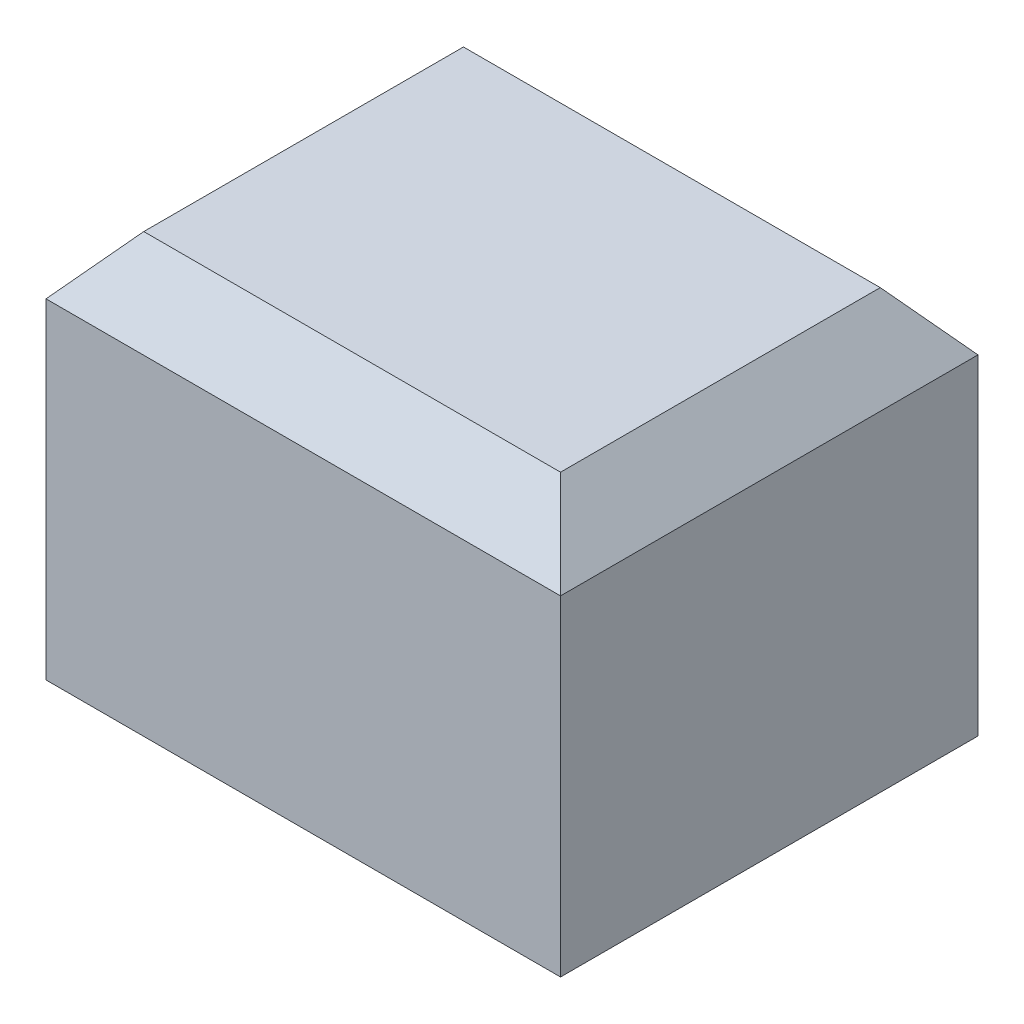
ISO-10303-21;
HEADER;
FILE_DESCRIPTION(('STEP AP214'),'2;1');
FILE_NAME('part.step','',(''),(''),'','','');
FILE_SCHEMA(('AUTOMOTIVE_DESIGN { 1 0 10303 214 1 1 1 1 }'));
ENDSEC;
DATA;
#1=APPLICATION_CONTEXT('core data for automotive mechanical design processes');
#2=APPLICATION_PROTOCOL_DEFINITION('international standard','automotive_design',2000,#1);
#3=PRODUCT_CONTEXT('',#1,'mechanical');
#4=PRODUCT('Part','Part','',(#3));
#5=PRODUCT_RELATED_PRODUCT_CATEGORY('part','',(#4));
#6=PRODUCT_DEFINITION_FORMATION('','',#4);
#7=PRODUCT_DEFINITION_CONTEXT('part definition',#1,'design');
#8=PRODUCT_DEFINITION('design','',#6,#7);
#9=PRODUCT_DEFINITION_SHAPE('','',#8);
#10=(LENGTH_UNIT() NAMED_UNIT(*) SI_UNIT(.MILLI.,.METRE.));
#11=(NAMED_UNIT(*) PLANE_ANGLE_UNIT() SI_UNIT($,.RADIAN.));
#12=(NAMED_UNIT(*) SI_UNIT($,.STERADIAN.) SOLID_ANGLE_UNIT());
#13=UNCERTAINTY_MEASURE_WITH_UNIT(LENGTH_MEASURE(1.E-05),#10,'distance_accuracy_value','');
#14=(GEOMETRIC_REPRESENTATION_CONTEXT(3) GLOBAL_UNCERTAINTY_ASSIGNED_CONTEXT((#13)) GLOBAL_UNIT_ASSIGNED_CONTEXT((#10,
#11,#12)) REPRESENTATION_CONTEXT('',''));
#15=CARTESIAN_POINT('',(0.,0.,0.));
#16=DIRECTION('',(0.,0.,1.));
#17=DIRECTION('',(1.,0.,0.));
#18=AXIS2_PLACEMENT_3D('',#15,#16,#17);
#19=CARTESIAN_POINT('',(0.,0.,0.));
#20=DIRECTION('',(0.,-1.,0.));
#21=DIRECTION('',(0.,0.,-1.));
#22=AXIS2_PLACEMENT_3D('',#19,#20,#21);
#23=PLANE('',#22);
#24=DIRECTION('',(0.,0.,1.));
#25=VECTOR('',#24,1.);
#26=CARTESIAN_POINT('',(-2.65,0.,2.15));
#27=LINE('',#26,#25);
#28=CARTESIAN_POINT('',(-2.65,0.,-2.15));
#29=VERTEX_POINT('',#28);
#30=CARTESIAN_POINT('',(-2.65,0.,2.15));
#31=VERTEX_POINT('',#30);
#32=EDGE_CURVE('E153',#29,#31,#27,.T.);
#33=ORIENTED_EDGE('',*,*,#32,.F.);
#34=DIRECTION('',(-1.,0.,0.));
#35=VECTOR('',#34,1.);
#36=CARTESIAN_POINT('',(-2.65,0.,-2.15));
#37=LINE('',#36,#35);
#38=CARTESIAN_POINT('',(2.65,0.,-2.15));
#39=VERTEX_POINT('',#38);
#40=EDGE_CURVE('E172',#39,#29,#37,.T.);
#41=ORIENTED_EDGE('',*,*,#40,.F.);
#42=DIRECTION('',(0.,0.,-1.));
#43=VECTOR('',#42,1.);
#44=CARTESIAN_POINT('',(2.65,0.,2.15));
#45=LINE('',#44,#43);
#46=CARTESIAN_POINT('',(2.65,0.,2.15));
#47=VERTEX_POINT('',#46);
#48=EDGE_CURVE('E168',#47,#39,#45,.T.);
#49=ORIENTED_EDGE('',*,*,#48,.F.);
#50=DIRECTION('',(1.,0.,0.));
#51=VECTOR('',#50,1.);
#52=CARTESIAN_POINT('',(-2.65,0.,2.15));
#53=LINE('',#52,#51);
#54=EDGE_CURVE('E159',#31,#47,#53,.T.);
#55=ORIENTED_EDGE('',*,*,#54,.F.);
#56=EDGE_LOOP('',(#33,#41,#49,#55));
#57=FACE_BOUND('',#56,.T.);
#58=DIRECTION('',(1.,0.,0.));
#59=VECTOR('',#58,1.);
#60=CARTESIAN_POINT('',(-1.55,0.,1.05));
#61=LINE('',#60,#59);
#62=CARTESIAN_POINT('',(-1.55,0.,1.05));
#63=VERTEX_POINT('',#62);
#64=CARTESIAN_POINT('',(1.55,0.,1.05));
#65=VERTEX_POINT('',#64);
#66=EDGE_CURVE('E147',#63,#65,#61,.T.);
#67=ORIENTED_EDGE('',*,*,#66,.T.);
#68=DIRECTION('',(0.,0.,-1.));
#69=VECTOR('',#68,1.);
#70=CARTESIAN_POINT('',(1.55,0.,1.05));
#71=LINE('',#70,#69);
#72=CARTESIAN_POINT('',(1.55,0.,-1.05));
#73=VERTEX_POINT('',#72);
#74=EDGE_CURVE('E223',#65,#73,#71,.T.);
#75=ORIENTED_EDGE('',*,*,#74,.T.);
#76=DIRECTION('',(-1.,0.,0.));
#77=VECTOR('',#76,1.);
#78=CARTESIAN_POINT('',(-1.55,0.,-1.05));
#79=LINE('',#78,#77);
#80=CARTESIAN_POINT('',(-1.55,0.,-1.05));
#81=VERTEX_POINT('',#80);
#82=EDGE_CURVE('E151',#73,#81,#79,.T.);
#83=ORIENTED_EDGE('',*,*,#82,.T.);
#84=DIRECTION('',(0.,0.,1.));
#85=VECTOR('',#84,1.);
#86=CARTESIAN_POINT('',(-1.55,0.,1.05));
#87=LINE('',#86,#85);
#88=EDGE_CURVE('E232',#81,#63,#87,.T.);
#89=ORIENTED_EDGE('',*,*,#88,.T.);
#90=EDGE_LOOP('',(#67,#75,#83,#89));
#91=FACE_BOUND('',#90,.T.);
#92=ADVANCED_FACE('F47',(#57,#91),#23,.T.);
#93=CARTESIAN_POINT('',(-2.65,2.8,2.15));
#94=DIRECTION('',(1.,0.,0.));
#95=DIRECTION('',(0.,0.,-1.));
#96=AXIS2_PLACEMENT_3D('',#93,#94,#95);
#97=PLANE('',#96);
#98=DIRECTION('',(0.,-1.,0.));
#99=VECTOR('',#98,1.);
#100=CARTESIAN_POINT('',(-2.65,2.8,2.15));
#101=LINE('',#100,#99);
#102=CARTESIAN_POINT('',(-2.65,3.4,2.15));
#103=VERTEX_POINT('',#102);
#104=EDGE_CURVE('E185',#103,#31,#101,.T.);
#105=ORIENTED_EDGE('',*,*,#104,.F.);
#106=DIRECTION('',(0.,0.,-1.));
#107=VECTOR('',#106,1.);
#108=CARTESIAN_POINT('',(-2.65,3.4,2.15));
#109=LINE('',#108,#107);
#110=CARTESIAN_POINT('',(-2.65,3.4,-2.15));
#111=VERTEX_POINT('',#110);
#112=EDGE_CURVE('E11',#103,#111,#109,.T.);
#113=ORIENTED_EDGE('',*,*,#112,.T.);
#114=DIRECTION('',(0.,-1.,0.));
#115=VECTOR('',#114,1.);
#116=CARTESIAN_POINT('',(-2.65,2.8,-2.15));
#117=LINE('',#116,#115);
#118=EDGE_CURVE('E176',#111,#29,#117,.T.);
#119=ORIENTED_EDGE('',*,*,#118,.T.);
#120=ORIENTED_EDGE('',*,*,#32,.T.);
#121=EDGE_LOOP('',(#105,#113,#119,#120));
#122=FACE_BOUND('',#121,.T.);
#123=ADVANCED_FACE('F253',(#122),#97,.F.);
#124=CARTESIAN_POINT('',(-2.65,2.8,2.15));
#125=DIRECTION('',(0.,0.,-1.));
#126=DIRECTION('',(-1.,0.,0.));
#127=AXIS2_PLACEMENT_3D('',#124,#125,#126);
#128=PLANE('',#127);
#129=DIRECTION('',(0.,-1.,0.));
#130=VECTOR('',#129,1.);
#131=CARTESIAN_POINT('',(2.65,2.8,2.15));
#132=LINE('',#131,#130);
#133=CARTESIAN_POINT('',(2.65,3.4,2.15));
#134=VERTEX_POINT('',#133);
#135=EDGE_CURVE('E182',#134,#47,#132,.T.);
#136=ORIENTED_EDGE('',*,*,#135,.F.);
#137=DIRECTION('',(-1.,0.,0.));
#138=VECTOR('',#137,1.);
#139=CARTESIAN_POINT('',(-2.65,3.4,2.15));
#140=LINE('',#139,#138);
#141=EDGE_CURVE('E58',#134,#103,#140,.T.);
#142=ORIENTED_EDGE('',*,*,#141,.T.);
#143=ORIENTED_EDGE('',*,*,#104,.T.);
#144=ORIENTED_EDGE('',*,*,#54,.T.);
#145=EDGE_LOOP('',(#136,#142,#143,#144));
#146=FACE_BOUND('',#145,.T.);
#147=ADVANCED_FACE('F260',(#146),#128,.F.);
#148=CARTESIAN_POINT('',(2.65,2.8,2.15));
#149=DIRECTION('',(-1.,0.,0.));
#150=DIRECTION('',(0.,0.,1.));
#151=AXIS2_PLACEMENT_3D('',#148,#149,#150);
#152=PLANE('',#151);
#153=DIRECTION('',(0.,-1.,0.));
#154=VECTOR('',#153,1.);
#155=CARTESIAN_POINT('',(2.65,2.8,-2.15));
#156=LINE('',#155,#154);
#157=CARTESIAN_POINT('',(2.65,3.4,-2.15));
#158=VERTEX_POINT('',#157);
#159=EDGE_CURVE('E179',#158,#39,#156,.T.);
#160=ORIENTED_EDGE('',*,*,#159,.F.);
#161=DIRECTION('',(0.,0.,1.));
#162=VECTOR('',#161,1.);
#163=CARTESIAN_POINT('',(2.65,3.4,2.15));
#164=LINE('',#163,#162);
#165=EDGE_CURVE('E73',#158,#134,#164,.T.);
#166=ORIENTED_EDGE('',*,*,#165,.T.);
#167=ORIENTED_EDGE('',*,*,#135,.T.);
#168=ORIENTED_EDGE('',*,*,#48,.T.);
#169=EDGE_LOOP('',(#160,#166,#167,#168));
#170=FACE_BOUND('',#169,.T.);
#171=ADVANCED_FACE('F270',(#170),#152,.F.);
#172=CARTESIAN_POINT('',(-2.65,2.8,-2.15));
#173=DIRECTION('',(0.,0.,1.));
#174=DIRECTION('',(1.,0.,0.));
#175=AXIS2_PLACEMENT_3D('',#172,#173,#174);
#176=PLANE('',#175);
#177=ORIENTED_EDGE('',*,*,#118,.F.);
#178=DIRECTION('',(1.,0.,0.));
#179=VECTOR('',#178,1.);
#180=CARTESIAN_POINT('',(-2.65,3.4,-2.15));
#181=LINE('',#180,#179);
#182=EDGE_CURVE('E201',#111,#158,#181,.T.);
#183=ORIENTED_EDGE('',*,*,#182,.T.);
#184=ORIENTED_EDGE('',*,*,#159,.T.);
#185=ORIENTED_EDGE('',*,*,#40,.T.);
#186=EDGE_LOOP('',(#177,#183,#184,#185));
#187=FACE_BOUND('',#186,.T.);
#188=ADVANCED_FACE('F267',(#187),#176,.F.);
#189=CARTESIAN_POINT('',(1.55,2.8,1.05));
#190=DIRECTION('',(-1.,0.,0.));
#191=DIRECTION('',(0.,0.,1.));
#192=AXIS2_PLACEMENT_3D('',#189,#190,#191);
#193=PLANE('',#192);
#194=ORIENTED_EDGE('',*,*,#74,.F.);
#195=DIRECTION('',(0.,-1.,0.));
#196=VECTOR('',#195,1.);
#197=CARTESIAN_POINT('',(1.55,2.8,1.05));
#198=LINE('',#197,#196);
#199=CARTESIAN_POINT('',(1.55,2.8,1.05));
#200=VERTEX_POINT('',#199);
#201=EDGE_CURVE('E145',#200,#65,#198,.T.);
#202=ORIENTED_EDGE('',*,*,#201,.F.);
#203=DIRECTION('',(0.,0.,-1.));
#204=VECTOR('',#203,1.);
#205=CARTESIAN_POINT('',(1.55,2.8,1.05));
#206=LINE('',#205,#204);
#207=CARTESIAN_POINT('',(1.55,2.8,-1.05));
#208=VERTEX_POINT('',#207);
#209=EDGE_CURVE('E129',#200,#208,#206,.T.);
#210=ORIENTED_EDGE('',*,*,#209,.T.);
#211=DIRECTION('',(0.,-1.,0.));
#212=VECTOR('',#211,1.);
#213=CARTESIAN_POINT('',(1.55,2.8,-1.05));
#214=LINE('',#213,#212);
#215=EDGE_CURVE('E142',#208,#73,#214,.T.);
#216=ORIENTED_EDGE('',*,*,#215,.T.);
#217=EDGE_LOOP('',(#194,#202,#210,#216));
#218=FACE_BOUND('',#217,.T.);
#219=ADVANCED_FACE('F141',(#218),#193,.T.);
#220=CARTESIAN_POINT('',(-1.55,2.8,-1.05));
#221=DIRECTION('',(0.,0.,1.));
#222=DIRECTION('',(1.,0.,0.));
#223=AXIS2_PLACEMENT_3D('',#220,#221,#222);
#224=PLANE('',#223);
#225=ORIENTED_EDGE('',*,*,#82,.F.);
#226=ORIENTED_EDGE('',*,*,#215,.F.);
#227=DIRECTION('',(-1.,0.,0.));
#228=VECTOR('',#227,1.);
#229=CARTESIAN_POINT('',(-1.55,2.8,-1.05));
#230=LINE('',#229,#228);
#231=CARTESIAN_POINT('',(-1.55,2.8,-1.05));
#232=VERTEX_POINT('',#231);
#233=EDGE_CURVE('E126',#208,#232,#230,.T.);
#234=ORIENTED_EDGE('',*,*,#233,.T.);
#235=DIRECTION('',(0.,-1.,0.));
#236=VECTOR('',#235,1.);
#237=CARTESIAN_POINT('',(-1.55,2.8,-1.05));
#238=LINE('',#237,#236);
#239=EDGE_CURVE('E154',#232,#81,#238,.T.);
#240=ORIENTED_EDGE('',*,*,#239,.T.);
#241=EDGE_LOOP('',(#225,#226,#234,#240));
#242=FACE_BOUND('',#241,.T.);
#243=ADVANCED_FACE('F149',(#242),#224,.T.);
#244=CARTESIAN_POINT('',(-1.55,2.8,1.05));
#245=DIRECTION('',(1.,0.,0.));
#246=DIRECTION('',(0.,0.,-1.));
#247=AXIS2_PLACEMENT_3D('',#244,#245,#246);
#248=PLANE('',#247);
#249=ORIENTED_EDGE('',*,*,#88,.F.);
#250=ORIENTED_EDGE('',*,*,#239,.F.);
#251=DIRECTION('',(0.,0.,1.));
#252=VECTOR('',#251,1.);
#253=CARTESIAN_POINT('',(-1.55,2.8,1.05));
#254=LINE('',#253,#252);
#255=CARTESIAN_POINT('',(-1.55,2.8,1.05));
#256=VERTEX_POINT('',#255);
#257=EDGE_CURVE('E132',#232,#256,#254,.T.);
#258=ORIENTED_EDGE('',*,*,#257,.T.);
#259=DIRECTION('',(0.,-1.,0.));
#260=VECTOR('',#259,1.);
#261=CARTESIAN_POINT('',(-1.55,2.8,1.05));
#262=LINE('',#261,#260);
#263=EDGE_CURVE('E161',#256,#63,#262,.T.);
#264=ORIENTED_EDGE('',*,*,#263,.T.);
#265=EDGE_LOOP('',(#249,#250,#258,#264));
#266=FACE_BOUND('',#265,.T.);
#267=ADVANCED_FACE('F249',(#266),#248,.T.);
#268=CARTESIAN_POINT('',(-1.55,2.8,1.05));
#269=DIRECTION('',(0.,0.,-1.));
#270=DIRECTION('',(-1.,0.,0.));
#271=AXIS2_PLACEMENT_3D('',#268,#269,#270);
#272=PLANE('',#271);
#273=ORIENTED_EDGE('',*,*,#66,.F.);
#274=ORIENTED_EDGE('',*,*,#263,.F.);
#275=DIRECTION('',(1.,0.,0.));
#276=VECTOR('',#275,1.);
#277=CARTESIAN_POINT('',(-1.55,2.8,1.05));
#278=LINE('',#277,#276);
#279=EDGE_CURVE('E235',#256,#200,#278,.T.);
#280=ORIENTED_EDGE('',*,*,#279,.T.);
#281=ORIENTED_EDGE('',*,*,#201,.T.);
#282=EDGE_LOOP('',(#273,#274,#280,#281));
#283=FACE_BOUND('',#282,.T.);
#284=ADVANCED_FACE('F251',(#283),#272,.T.);
#285=CARTESIAN_POINT('',(0.,2.8,0.));
#286=DIRECTION('',(0.,-1.,0.));
#287=DIRECTION('',(0.,0.,-1.));
#288=AXIS2_PLACEMENT_3D('',#285,#286,#287);
#289=PLANE('',#288);
#290=ORIENTED_EDGE('',*,*,#209,.F.);
#291=ORIENTED_EDGE('',*,*,#279,.F.);
#292=ORIENTED_EDGE('',*,*,#257,.F.);
#293=ORIENTED_EDGE('',*,*,#233,.F.);
#294=EDGE_LOOP('',(#290,#291,#292,#293));
#295=FACE_BOUND('',#294,.T.);
#296=ADVANCED_FACE('F128',(#295),#289,.T.);
#297=CARTESIAN_POINT('',(0.,4.,0.));
#298=DIRECTION('',(0.,-1.,0.));
#299=DIRECTION('',(0.,0.,-1.));
#300=AXIS2_PLACEMENT_3D('',#297,#298,#299);
#301=PLANE('',#300);
#302=DIRECTION('',(0.,0.,-1.));
#303=VECTOR('',#302,1.);
#304=CARTESIAN_POINT('',(2.14654022129363,4.,0.));
#305=LINE('',#304,#303);
#306=CARTESIAN_POINT('',(2.14654022129363,4.,1.64654022129363));
#307=VERTEX_POINT('',#306);
#308=CARTESIAN_POINT('',(2.14654022129363,4.,-1.64654022129363));
#309=VERTEX_POINT('',#308);
#310=EDGE_CURVE('E194',#307,#309,#305,.T.);
#311=ORIENTED_EDGE('',*,*,#310,.T.);
#312=DIRECTION('',(-1.,0.,0.));
#313=VECTOR('',#312,1.);
#314=CARTESIAN_POINT('',(0.,4.,-1.64654022129363));
#315=LINE('',#314,#313);
#316=CARTESIAN_POINT('',(-2.14654022129363,4.,-1.64654022129363));
#317=VERTEX_POINT('',#316);
#318=EDGE_CURVE('E197',#309,#317,#315,.T.);
#319=ORIENTED_EDGE('',*,*,#318,.T.);
#320=DIRECTION('',(0.,0.,1.));
#321=VECTOR('',#320,1.);
#322=CARTESIAN_POINT('',(-2.14654022129363,4.,0.));
#323=LINE('',#322,#321);
#324=CARTESIAN_POINT('',(-2.14654022129363,4.,1.64654022129363));
#325=VERTEX_POINT('',#324);
#326=EDGE_CURVE('E188',#317,#325,#323,.T.);
#327=ORIENTED_EDGE('',*,*,#326,.T.);
#328=DIRECTION('',(1.,0.,0.));
#329=VECTOR('',#328,1.);
#330=CARTESIAN_POINT('',(0.,4.,1.64654022129363));
#331=LINE('',#330,#329);
#332=EDGE_CURVE('E191',#325,#307,#331,.T.);
#333=ORIENTED_EDGE('',*,*,#332,.T.);
#334=EDGE_LOOP('',(#311,#319,#327,#333));
#335=FACE_BOUND('',#334,.T.);
#336=ADVANCED_FACE('F296',(#335),#301,.F.);
#337=CARTESIAN_POINT('',(0.,4.,1.64654022129363));
#338=DIRECTION('',(0.,-0.642787609686537,-0.76604444311898));
#339=DIRECTION('',(1.,0.,0.));
#340=AXIS2_PLACEMENT_3D('',#337,#338,#339);
#341=PLANE('',#340);
#342=DIRECTION('',(0.540716203060936,0.644400477571774,-0.540716203060936));
#343=VECTOR('',#342,1.);
#344=CARTESIAN_POINT('',(-1.66513465045867,4.57371681853743,1.16513465045867));
#345=LINE('',#344,#343);
#346=EDGE_CURVE('E214',#103,#325,#345,.T.);
#347=ORIENTED_EDGE('',*,*,#346,.F.);
#348=ORIENTED_EDGE('',*,*,#141,.F.);
#349=DIRECTION('',(-0.540716203060936,0.644400477571774,-0.540716203060936));
#350=VECTOR('',#349,1.);
#351=CARTESIAN_POINT('',(1.51894764433235,4.74793570827907,1.01894764433235));
#352=LINE('',#351,#350);
#353=EDGE_CURVE('E52',#307,#134,#352,.F.);
#354=ORIENTED_EDGE('',*,*,#353,.F.);
#355=ORIENTED_EDGE('',*,*,#332,.F.);
#356=EDGE_LOOP('',(#347,#348,#354,#355));
#357=FACE_BOUND('',#356,.T.);
#358=ADVANCED_FACE('F50',(#357),#341,.F.);
#359=CARTESIAN_POINT('',(2.14654022129363,4.,0.));
#360=DIRECTION('',(-0.76604444311898,-0.642787609686537,0.));
#361=DIRECTION('',(0.,0.,-1.));
#362=AXIS2_PLACEMENT_3D('',#359,#360,#361);
#363=PLANE('',#362);
#364=ORIENTED_EDGE('',*,*,#353,.T.);
#365=ORIENTED_EDGE('',*,*,#165,.F.);
#366=DIRECTION('',(-0.540716203060936,0.644400477571774,0.540716203060936));
#367=VECTOR('',#366,1.);
#368=CARTESIAN_POINT('',(1.66513465045867,4.57371681853743,-1.16513465045867));
#369=LINE('',#368,#367);
#370=EDGE_CURVE('E212',#309,#158,#369,.F.);
#371=ORIENTED_EDGE('',*,*,#370,.F.);
#372=ORIENTED_EDGE('',*,*,#310,.F.);
#373=EDGE_LOOP('',(#364,#365,#371,#372));
#374=FACE_BOUND('',#373,.T.);
#375=ADVANCED_FACE('F289',(#374),#363,.F.);
#376=CARTESIAN_POINT('',(-2.14654022129363,4.,0.));
#377=DIRECTION('',(0.76604444311898,-0.642787609686537,0.));
#378=DIRECTION('',(0.,0.,1.));
#379=AXIS2_PLACEMENT_3D('',#376,#377,#378);
#380=PLANE('',#379);
#381=ORIENTED_EDGE('',*,*,#346,.T.);
#382=ORIENTED_EDGE('',*,*,#326,.F.);
#383=DIRECTION('',(-0.540716203060936,-0.644400477571774,-0.540716203060936));
#384=VECTOR('',#383,1.);
#385=CARTESIAN_POINT('',(-1.66513465045867,4.57371681853743,-1.16513465045867));
#386=LINE('',#385,#384);
#387=EDGE_CURVE('E209',#111,#317,#386,.F.);
#388=ORIENTED_EDGE('',*,*,#387,.F.);
#389=ORIENTED_EDGE('',*,*,#112,.F.);
#390=EDGE_LOOP('',(#381,#382,#388,#389));
#391=FACE_BOUND('',#390,.T.);
#392=ADVANCED_FACE('F283',(#391),#380,.F.);
#393=CARTESIAN_POINT('',(0.,4.,-1.64654022129363));
#394=DIRECTION('',(0.,-0.642787609686537,0.76604444311898));
#395=DIRECTION('',(-1.,0.,0.));
#396=AXIS2_PLACEMENT_3D('',#393,#394,#395);
#397=PLANE('',#396);
#398=ORIENTED_EDGE('',*,*,#370,.T.);
#399=ORIENTED_EDGE('',*,*,#182,.F.);
#400=ORIENTED_EDGE('',*,*,#387,.T.);
#401=ORIENTED_EDGE('',*,*,#318,.F.);
#402=EDGE_LOOP('',(#398,#399,#400,#401));
#403=FACE_BOUND('',#402,.T.);
#404=ADVANCED_FACE('F277',(#403),#397,.F.);
#405=CLOSED_SHELL('',(#92,#123,#147,#171,#188,#219,#243,#267,#284,#296,#336,#358,#375,#392,#404));
#406=MANIFOLD_SOLID_BREP('B2',#405);
#407=ADVANCED_BREP_SHAPE_REPRESENTATION('',(#18,#406),#14);
#408=SHAPE_DEFINITION_REPRESENTATION(#9,#407);
ENDSEC;
END-ISO-10303-21;
